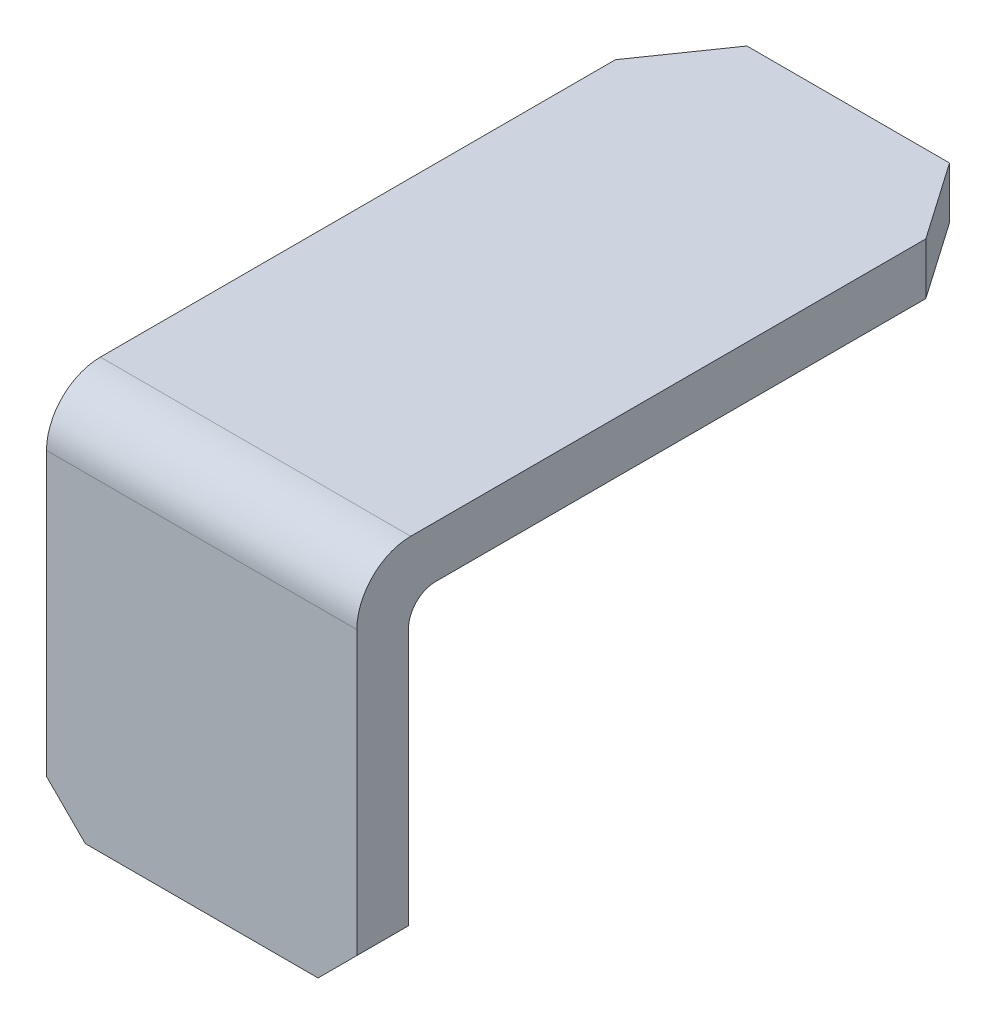
ISO-10303-21;
HEADER;
FILE_DESCRIPTION(('STEP AP214'),'2;1');
FILE_NAME('part.step','',(''),(''),'','','');
FILE_SCHEMA(('AUTOMOTIVE_DESIGN { 1 0 10303 214 1 1 1 1 }'));
ENDSEC;
DATA;
#1=APPLICATION_CONTEXT('core data for automotive mechanical design processes');
#2=APPLICATION_PROTOCOL_DEFINITION('international standard','automotive_design',2000,#1);
#3=PRODUCT_CONTEXT('',#1,'mechanical');
#4=PRODUCT('Part','Part','',(#3));
#5=PRODUCT_RELATED_PRODUCT_CATEGORY('part','',(#4));
#6=PRODUCT_DEFINITION_FORMATION('','',#4);
#7=PRODUCT_DEFINITION_CONTEXT('part definition',#1,'design');
#8=PRODUCT_DEFINITION('design','',#6,#7);
#9=PRODUCT_DEFINITION_SHAPE('','',#8);
#10=(LENGTH_UNIT() NAMED_UNIT(*) SI_UNIT(.MILLI.,.METRE.));
#11=(NAMED_UNIT(*) PLANE_ANGLE_UNIT() SI_UNIT($,.RADIAN.));
#12=(NAMED_UNIT(*) SI_UNIT($,.STERADIAN.) SOLID_ANGLE_UNIT());
#13=UNCERTAINTY_MEASURE_WITH_UNIT(LENGTH_MEASURE(1.E-05),#10,'distance_accuracy_value','');
#14=(GEOMETRIC_REPRESENTATION_CONTEXT(3) GLOBAL_UNCERTAINTY_ASSIGNED_CONTEXT((#13)) GLOBAL_UNIT_ASSIGNED_CONTEXT((#10,
#11,#12)) REPRESENTATION_CONTEXT('',''));
#15=CARTESIAN_POINT('',(0.,0.,0.));
#16=DIRECTION('',(0.,0.,1.));
#17=DIRECTION('',(1.,0.,0.));
#18=AXIS2_PLACEMENT_3D('',#15,#16,#17);
#19=CARTESIAN_POINT('',(-5.64963073780017,-15.4763679848659,-14.9606000000013));
#20=DIRECTION('',(0.,-1.,0.));
#21=DIRECTION('',(1.,0.,0.));
#22=AXIS2_PLACEMENT_3D('',#19,#20,#21);
#23=PLANE('',#22);
#24=DIRECTION('',(0.,0.,1.));
#25=VECTOR('',#24,1.);
#26=CARTESIAN_POINT('',(-7.36413073452841,-15.4763679848658,-15.595600000003));
#27=LINE('',#26,#25);
#28=CARTESIAN_POINT('',(-7.36413073452846,-15.4763679848659,-14.960600000002));
#29=VERTEX_POINT('',#28);
#30=CARTESIAN_POINT('',(-7.36413073452846,-15.4763679848659,-15.7226000000013));
#31=VERTEX_POINT('',#30);
#32=EDGE_CURVE('E237',#29,#31,#27,.F.);
#33=ORIENTED_EDGE('',*,*,#32,.T.);
#34=DIRECTION('',(-1.,0.,0.));
#35=VECTOR('',#34,1.);
#36=CARTESIAN_POINT('',(-5.64963073780017,-15.4763679848659,-15.7226000000013));
#37=LINE('',#36,#35);
#38=CARTESIAN_POINT('',(-3.93513073452857,-15.4763679848658,-15.7226000000013));
#39=VERTEX_POINT('',#38);
#40=EDGE_CURVE('E206',#39,#31,#37,.T.);
#41=ORIENTED_EDGE('',*,*,#40,.F.);
#42=DIRECTION('',(0.,0.,1.));
#43=VECTOR('',#42,1.);
#44=CARTESIAN_POINT('',(-3.93513073452876,-15.4763679848656,-15.5956000000031));
#45=LINE('',#44,#43);
#46=CARTESIAN_POINT('',(-3.93513073452866,-15.4763679848657,-14.9606000000017));
#47=VERTEX_POINT('',#46);
#48=EDGE_CURVE('E207',#39,#47,#45,.T.);
#49=ORIENTED_EDGE('',*,*,#48,.T.);
#50=DIRECTION('',(-1.,0.,0.));
#51=VECTOR('',#50,1.);
#52=CARTESIAN_POINT('',(-3.73034936274053E-13,-15.4763679848659,-14.9606000000024));
#53=LINE('',#52,#51);
#54=EDGE_CURVE('E231',#47,#29,#53,.T.);
#55=ORIENTED_EDGE('',*,*,#54,.T.);
#56=EDGE_LOOP('',(#33,#41,#49,#55));
#57=FACE_BOUND('',#56,.T.);
#58=ADVANCED_FACE('F17',(#57),#23,.T.);
#59=CARTESIAN_POINT('',(-5.64963073780019,-11.110742984866,-16.1194750000013));
#60=DIRECTION('',(-1.,0.,0.));
#61=DIRECTION('',(0.,0.,1.));
#62=AXIS2_PLACEMENT_3D('',#59,#60,#61);
#63=CYLINDRICAL_SURFACE('',#62,0.396875);
#64=DIRECTION('',(1.,0.,0.));
#65=VECTOR('',#64,1.);
#66=CARTESIAN_POINT('',(-5.64963073780019,-10.7138679848659,-16.1194750000012));
#67=LINE('',#66,#65);
#68=CARTESIAN_POINT('',(-3.36363073780018,-10.7138679848659,-16.1194750000013));
#69=VERTEX_POINT('',#68);
#70=CARTESIAN_POINT('',(-7.93563073780018,-10.7138679848659,-16.1194750000013));
#71=VERTEX_POINT('',#70);
#72=EDGE_CURVE('E118',#69,#71,#67,.F.);
#73=ORIENTED_EDGE('',*,*,#72,.F.);
#74=CARTESIAN_POINT('',(-3.36363073780019,-11.110742984866,-16.1194750000013));
#75=DIRECTION('',(-1.,0.,0.));
#76=DIRECTION('',(0.,0.,1.));
#77=AXIS2_PLACEMENT_3D('',#74,#75,#76);
#78=CIRCLE('',#77,0.396875);
#79=CARTESIAN_POINT('',(-3.36363073780019,-11.1107429848659,-15.7226000000013));
#80=VERTEX_POINT('',#79);
#81=EDGE_CURVE('E20',#80,#69,#78,.T.);
#82=ORIENTED_EDGE('',*,*,#81,.F.);
#83=DIRECTION('',(-1.,0.,0.));
#84=VECTOR('',#83,1.);
#85=CARTESIAN_POINT('',(-5.64963073780017,-11.1107429848659,-15.7226000000013));
#86=LINE('',#85,#84);
#87=CARTESIAN_POINT('',(-7.93563073780019,-11.1107429848659,-15.7226000000013));
#88=VERTEX_POINT('',#87);
#89=EDGE_CURVE('E124',#88,#80,#86,.F.);
#90=ORIENTED_EDGE('',*,*,#89,.F.);
#91=CARTESIAN_POINT('',(-7.93563073780019,-11.110742984866,-16.1194750000013));
#92=DIRECTION('',(-1.,0.,0.));
#93=DIRECTION('',(0.,0.,1.));
#94=AXIS2_PLACEMENT_3D('',#91,#92,#93);
#95=CIRCLE('',#94,0.396875);
#96=EDGE_CURVE('E116',#71,#88,#95,.F.);
#97=ORIENTED_EDGE('',*,*,#96,.F.);
#98=EDGE_LOOP('',(#73,#82,#90,#97));
#99=FACE_BOUND('',#98,.T.);
#100=ADVANCED_FACE('F119',(#99),#63,.F.);
#101=CARTESIAN_POINT('',(-12.9089698634811,-9.93152885591314,-15.595600000003));
#102=DIRECTION('',(0.707106781186547,0.707106781186548,0.));
#103=DIRECTION('',(-0.707106781186548,0.707106781186547,0.));
#104=AXIS2_PLACEMENT_3D('',#101,#102,#103);
#105=PLANE('',#104);
#106=DIRECTION('',(-0.707106781186541,0.707106781186554,0.));
#107=VECTOR('',#106,1.);
#108=CARTESIAN_POINT('',(-7.36413073452848,-15.4763679848659,-14.9606000000024));
#109=LINE('',#108,#107);
#110=CARTESIAN_POINT('',(-7.93563073780017,-14.9048679815942,-14.9606000000016));
#111=VERTEX_POINT('',#110);
#112=EDGE_CURVE('E215',#29,#111,#109,.T.);
#113=ORIENTED_EDGE('',*,*,#112,.T.);
#114=DIRECTION('',(0.,0.,-1.));
#115=VECTOR('',#114,1.);
#116=CARTESIAN_POINT('',(-7.93563073780017,-14.9048679815942,-18.3929227095899));
#117=LINE('',#116,#115);
#118=CARTESIAN_POINT('',(-7.93563073780017,-14.9048679815942,-15.7226000000012));
#119=VERTEX_POINT('',#118);
#120=EDGE_CURVE('E177',#111,#119,#117,.T.);
#121=ORIENTED_EDGE('',*,*,#120,.T.);
#122=DIRECTION('',(-0.707106781186541,0.707106781186554,0.));
#123=VECTOR('',#122,1.);
#124=CARTESIAN_POINT('',(-7.36413073452848,-15.4763679848659,-15.7226000000013));
#125=LINE('',#124,#123);
#126=EDGE_CURVE('E202',#31,#119,#125,.T.);
#127=ORIENTED_EDGE('',*,*,#126,.F.);
#128=ORIENTED_EDGE('',*,*,#32,.F.);
#129=EDGE_LOOP('',(#113,#121,#127,#128));
#130=FACE_BOUND('',#129,.T.);
#131=ADVANCED_FACE('F266',(#130),#105,.F.);
#132=CARTESIAN_POINT('',(-3.73034936274053E-13,8.34887714518118E-13,-14.9606000000024));
#133=DIRECTION('',(0.,0.,-1.));
#134=DIRECTION('',(-1.,0.,0.));
#135=AXIS2_PLACEMENT_3D('',#132,#133,#134);
#136=PLANE('',#135);
#137=ORIENTED_EDGE('',*,*,#54,.F.);
#138=DIRECTION('',(-0.707106781186548,-0.707106781186548,0.));
#139=VECTOR('',#138,1.);
#140=CARTESIAN_POINT('',(6.80372662895213,-4.73751062138474,-14.9606000000013));
#141=LINE('',#140,#139);
#142=CARTESIAN_POINT('',(-3.36363073780026,-14.9048679881375,-14.9606000000012));
#143=VERTEX_POINT('',#142);
#144=EDGE_CURVE('E213',#47,#143,#141,.F.);
#145=ORIENTED_EDGE('',*,*,#144,.T.);
#146=DIRECTION('',(0.,1.,0.));
#147=VECTOR('',#146,1.);
#148=CARTESIAN_POINT('',(-3.36363073780017,-11.3493939283856,-14.9606000000012));
#149=LINE('',#148,#147);
#150=CARTESIAN_POINT('',(-3.36363073780018,-10.745617984866,-14.9606000000012));
#151=VERTEX_POINT('',#150);
#152=EDGE_CURVE('E140',#151,#143,#149,.F.);
#153=ORIENTED_EDGE('',*,*,#152,.F.);
#154=DIRECTION('',(-1.,0.,0.));
#155=VECTOR('',#154,1.);
#156=CARTESIAN_POINT('',(-5.64963073780019,-10.745617984866,-14.9606000000012));
#157=LINE('',#156,#155);
#158=CARTESIAN_POINT('',(-7.93563073780018,-10.745617984866,-14.9606000000012));
#159=VERTEX_POINT('',#158);
#160=EDGE_CURVE('E218',#159,#151,#157,.F.);
#161=ORIENTED_EDGE('',*,*,#160,.F.);
#162=DIRECTION('',(0.,1.,0.));
#163=VECTOR('',#162,1.);
#164=CARTESIAN_POINT('',(-7.93563073780017,-11.3493939283856,-14.9606000000012));
#165=LINE('',#164,#163);
#166=EDGE_CURVE('E180',#159,#111,#165,.F.);
#167=ORIENTED_EDGE('',*,*,#166,.T.);
#168=ORIENTED_EDGE('',*,*,#112,.F.);
#169=EDGE_LOOP('',(#137,#145,#153,#161,#167,#168));
#170=FACE_BOUND('',#169,.T.);
#171=ADVANCED_FACE('F272',(#170),#136,.F.);
#172=CARTESIAN_POINT('',(6.80372662895213,-4.73751062138474,-15.5956000000031));
#173=DIRECTION('',(-0.707106781186548,0.707106781186548,0.));
#174=DIRECTION('',(-0.707106781186548,-0.707106781186548,0.));
#175=AXIS2_PLACEMENT_3D('',#172,#173,#174);
#176=PLANE('',#175);
#177=DIRECTION('',(-0.707106781186553,-0.707106781186542,0.));
#178=VECTOR('',#177,1.);
#179=CARTESIAN_POINT('',(-3.36363073780017,-14.9048679881376,-15.7226000000013));
#180=LINE('',#179,#178);
#181=CARTESIAN_POINT('',(-3.36363073780017,-14.9048679881376,-15.7226000000012));
#182=VERTEX_POINT('',#181);
#183=EDGE_CURVE('E203',#182,#39,#180,.T.);
#184=ORIENTED_EDGE('',*,*,#183,.F.);
#185=DIRECTION('',(0.,0.,-1.));
#186=VECTOR('',#185,1.);
#187=CARTESIAN_POINT('',(-3.36363073780017,-14.9048679881376,-18.3929227095899));
#188=LINE('',#187,#186);
#189=EDGE_CURVE('E132',#143,#182,#188,.T.);
#190=ORIENTED_EDGE('',*,*,#189,.F.);
#191=ORIENTED_EDGE('',*,*,#144,.F.);
#192=ORIENTED_EDGE('',*,*,#48,.F.);
#193=EDGE_LOOP('',(#184,#190,#191,#192));
#194=FACE_BOUND('',#193,.T.);
#195=ADVANCED_FACE('F288',(#194),#176,.F.);
#196=CARTESIAN_POINT('',(-5.64963073780017,-15.4763679848659,-15.7226000000013));
#197=DIRECTION('',(0.,0.,-1.));
#198=DIRECTION('',(-1.,0.,0.));
#199=AXIS2_PLACEMENT_3D('',#196,#197,#198);
#200=PLANE('',#199);
#201=ORIENTED_EDGE('',*,*,#89,.T.);
#202=DIRECTION('',(0.,1.,0.));
#203=VECTOR('',#202,1.);
#204=CARTESIAN_POINT('',(-3.36363073780017,-11.3493939283856,-15.7226000000012));
#205=LINE('',#204,#203);
#206=EDGE_CURVE('E115',#182,#80,#205,.T.);
#207=ORIENTED_EDGE('',*,*,#206,.F.);
#208=ORIENTED_EDGE('',*,*,#183,.T.);
#209=ORIENTED_EDGE('',*,*,#40,.T.);
#210=ORIENTED_EDGE('',*,*,#126,.T.);
#211=DIRECTION('',(0.,1.,0.));
#212=VECTOR('',#211,1.);
#213=CARTESIAN_POINT('',(-7.93563073780017,-11.3493939283856,-15.7226000000012));
#214=LINE('',#213,#212);
#215=EDGE_CURVE('E172',#119,#88,#214,.T.);
#216=ORIENTED_EDGE('',*,*,#215,.T.);
#217=EDGE_LOOP('',(#201,#207,#208,#209,#210,#216));
#218=FACE_BOUND('',#217,.T.);
#219=ADVANCED_FACE('F261',(#218),#200,.T.);
#220=CARTESIAN_POINT('',(-5.64963073780019,-10.7138679848659,-16.1194750000012));
#221=DIRECTION('',(0.,-1.,0.));
#222=DIRECTION('',(1.,0.,0.));
#223=AXIS2_PLACEMENT_3D('',#220,#221,#222);
#224=PLANE('',#223);
#225=DIRECTION('',(-1.,0.,0.));
#226=VECTOR('',#225,1.);
#227=CARTESIAN_POINT('',(-5.64963073780035,-10.7138679848655,-24.4856000000024));
#228=LINE('',#227,#226);
#229=CARTESIAN_POINT('',(-4.15738073780026,-10.7138679848655,-24.4856000000025));
#230=VERTEX_POINT('',#229);
#231=CARTESIAN_POINT('',(-7.14188073780036,-10.7138679848657,-24.4856000000024));
#232=VERTEX_POINT('',#231);
#233=EDGE_CURVE('E193',#230,#232,#228,.T.);
#234=ORIENTED_EDGE('',*,*,#233,.F.);
#235=DIRECTION('',(-0.570395809495346,0.,-0.821369965673295));
#236=VECTOR('',#235,1.);
#237=CARTESIAN_POINT('',(-3.76050573780034,-10.7138679848655,-23.9141000000026));
#238=LINE('',#237,#236);
#239=CARTESIAN_POINT('',(-3.36363073780024,-10.7138679848656,-23.3426000000025));
#240=VERTEX_POINT('',#239);
#241=EDGE_CURVE('E128',#240,#230,#238,.T.);
#242=ORIENTED_EDGE('',*,*,#241,.F.);
#243=DIRECTION('',(0.,0.,-1.));
#244=VECTOR('',#243,1.);
#245=CARTESIAN_POINT('',(-3.36363073780017,-10.7138679848659,-18.3929227095899));
#246=LINE('',#245,#244);
#247=EDGE_CURVE('E111',#69,#240,#246,.T.);
#248=ORIENTED_EDGE('',*,*,#247,.F.);
#249=ORIENTED_EDGE('',*,*,#72,.T.);
#250=DIRECTION('',(0.,0.,-1.));
#251=VECTOR('',#250,1.);
#252=CARTESIAN_POINT('',(-7.93563073780017,-10.7138679848659,-18.3929227095899));
#253=LINE('',#252,#251);
#254=CARTESIAN_POINT('',(-7.93563073780027,-10.7138679848658,-23.3426000000025));
#255=VERTEX_POINT('',#254);
#256=EDGE_CURVE('E169',#71,#255,#253,.T.);
#257=ORIENTED_EDGE('',*,*,#256,.T.);
#258=DIRECTION('',(0.570395809495344,0.,-0.821369965673296));
#259=VECTOR('',#258,1.);
#260=CARTESIAN_POINT('',(-7.93563073780035,-10.7138679848659,-23.3426000000024));
#261=LINE('',#260,#259);
#262=EDGE_CURVE('E123',#255,#232,#261,.T.);
#263=ORIENTED_EDGE('',*,*,#262,.T.);
#264=EDGE_LOOP('',(#234,#242,#248,#249,#257,#263));
#265=FACE_BOUND('',#264,.T.);
#266=ADVANCED_FACE('F127',(#265),#224,.T.);
#267=CARTESIAN_POINT('',(-7.93563073780017,-11.3493939283856,-18.3929227095899));
#268=DIRECTION('',(1.,0.,0.));
#269=DIRECTION('',(0.,0.,-1.));
#270=AXIS2_PLACEMENT_3D('',#267,#268,#269);
#271=PLANE('',#270);
#272=ORIENTED_EDGE('',*,*,#96,.T.);
#273=ORIENTED_EDGE('',*,*,#215,.F.);
#274=ORIENTED_EDGE('',*,*,#120,.F.);
#275=ORIENTED_EDGE('',*,*,#166,.F.);
#276=CARTESIAN_POINT('',(-7.93563073780019,-10.745617984866,-15.7543500000012));
#277=DIRECTION('',(-1.,0.,0.));
#278=DIRECTION('',(0.,0.,1.));
#279=AXIS2_PLACEMENT_3D('',#276,#277,#278);
#280=CIRCLE('',#279,0.79375);
#281=CARTESIAN_POINT('',(-7.93563073780027,-9.95186798486595,-15.7543500000012));
#282=VERTEX_POINT('',#281);
#283=EDGE_CURVE('E171',#282,#159,#280,.F.);
#284=ORIENTED_EDGE('',*,*,#283,.F.);
#285=DIRECTION('',(0.,0.,1.));
#286=VECTOR('',#285,1.);
#287=CARTESIAN_POINT('',(-7.93563073780035,-9.95186798486595,-24.4856000000012));
#288=LINE('',#287,#286);
#289=CARTESIAN_POINT('',(-7.93563073780038,-9.95186798486595,-23.3426000000024));
#290=VERTEX_POINT('',#289);
#291=EDGE_CURVE('E150',#290,#282,#288,.T.);
#292=ORIENTED_EDGE('',*,*,#291,.F.);
#293=DIRECTION('',(0.,1.,0.));
#294=VECTOR('',#293,1.);
#295=CARTESIAN_POINT('',(-7.93563073780045,-11.0316309566253,-23.3426000000025));
#296=LINE('',#295,#294);
#297=EDGE_CURVE('E166',#255,#290,#296,.T.);
#298=ORIENTED_EDGE('',*,*,#297,.F.);
#299=ORIENTED_EDGE('',*,*,#256,.F.);
#300=EDGE_LOOP('',(#272,#273,#274,#275,#284,#292,#298,#299));
#301=FACE_BOUND('',#300,.T.);
#302=ADVANCED_FACE('F257',(#301),#271,.F.);
#303=CARTESIAN_POINT('',(-5.64963073780019,-10.745617984866,-15.7543500000012));
#304=DIRECTION('',(-1.,0.,0.));
#305=DIRECTION('',(0.,0.,1.));
#306=AXIS2_PLACEMENT_3D('',#303,#304,#305);
#307=CYLINDRICAL_SURFACE('',#306,0.79375);
#308=CARTESIAN_POINT('',(-3.36363073780019,-10.745617984866,-15.7543500000012));
#309=DIRECTION('',(-1.,0.,0.));
#310=DIRECTION('',(0.,0.,1.));
#311=AXIS2_PLACEMENT_3D('',#308,#309,#310);
#312=CIRCLE('',#311,0.79375);
#313=CARTESIAN_POINT('',(-3.36363073780019,-9.95186798486595,-15.7543500000012));
#314=VERTEX_POINT('',#313);
#315=EDGE_CURVE('E143',#314,#151,#312,.F.);
#316=ORIENTED_EDGE('',*,*,#315,.F.);
#317=DIRECTION('',(-1.,0.,0.));
#318=VECTOR('',#317,1.);
#319=CARTESIAN_POINT('',(-5.64963073780017,-9.95186798486595,-15.7543500000012));
#320=LINE('',#319,#318);
#321=EDGE_CURVE('E146',#282,#314,#320,.F.);
#322=ORIENTED_EDGE('',*,*,#321,.F.);
#323=ORIENTED_EDGE('',*,*,#283,.T.);
#324=ORIENTED_EDGE('',*,*,#160,.T.);
#325=EDGE_LOOP('',(#316,#322,#323,#324));
#326=FACE_BOUND('',#325,.T.);
#327=ADVANCED_FACE('F274',(#326),#307,.T.);
#328=CARTESIAN_POINT('',(-3.36363073780017,-11.3493939283856,-18.3929227095899));
#329=DIRECTION('',(1.,0.,0.));
#330=DIRECTION('',(0.,0.,-1.));
#331=AXIS2_PLACEMENT_3D('',#328,#329,#330);
#332=PLANE('',#331);
#333=ORIENTED_EDGE('',*,*,#247,.T.);
#334=DIRECTION('',(0.,1.,0.));
#335=VECTOR('',#334,1.);
#336=CARTESIAN_POINT('',(-3.3636307378003,-11.0316309566254,-23.3426000000025));
#337=LINE('',#336,#335);
#338=CARTESIAN_POINT('',(-3.36363073780025,-9.95186798486595,-23.3426000000024));
#339=VERTEX_POINT('',#338);
#340=EDGE_CURVE('E130',#339,#240,#337,.F.);
#341=ORIENTED_EDGE('',*,*,#340,.F.);
#342=DIRECTION('',(0.,0.,1.));
#343=VECTOR('',#342,1.);
#344=CARTESIAN_POINT('',(-3.36363073780019,-9.95186798486595,-24.4856000000012));
#345=LINE('',#344,#343);
#346=EDGE_CURVE('E149',#314,#339,#345,.F.);
#347=ORIENTED_EDGE('',*,*,#346,.F.);
#348=ORIENTED_EDGE('',*,*,#315,.T.);
#349=ORIENTED_EDGE('',*,*,#152,.T.);
#350=ORIENTED_EDGE('',*,*,#189,.T.);
#351=ORIENTED_EDGE('',*,*,#206,.T.);
#352=ORIENTED_EDGE('',*,*,#81,.T.);
#353=EDGE_LOOP('',(#333,#341,#347,#348,#349,#350,#351,#352));
#354=FACE_BOUND('',#353,.T.);
#355=ADVANCED_FACE('F109',(#354),#332,.T.);
#356=CARTESIAN_POINT('',(-3.76050573780034,-11.0316309566254,-23.9141000000026));
#357=DIRECTION('',(0.821369965673295,0.,-0.570395809495346));
#358=DIRECTION('',(-0.570395809495346,0.,-0.821369965673295));
#359=AXIS2_PLACEMENT_3D('',#356,#357,#358);
#360=PLANE('',#359);
#361=DIRECTION('',(-0.570395809495349,0.,-0.821369965673293));
#362=VECTOR('',#361,1.);
#363=CARTESIAN_POINT('',(-3.36363073780035,-9.95186798486595,-23.3426000000025));
#364=LINE('',#363,#362);
#365=CARTESIAN_POINT('',(-4.15738073780031,-9.95186798486564,-24.4856000000025));
#366=VERTEX_POINT('',#365);
#367=EDGE_CURVE('E153',#339,#366,#364,.T.);
#368=ORIENTED_EDGE('',*,*,#367,.F.);
#369=ORIENTED_EDGE('',*,*,#340,.T.);
#370=ORIENTED_EDGE('',*,*,#241,.T.);
#371=DIRECTION('',(0.,1.,0.));
#372=VECTOR('',#371,1.);
#373=CARTESIAN_POINT('',(-4.15738073780036,-10.7138679848655,-24.4856000000024));
#374=LINE('',#373,#372);
#375=EDGE_CURVE('E161',#366,#230,#374,.F.);
#376=ORIENTED_EDGE('',*,*,#375,.F.);
#377=EDGE_LOOP('',(#368,#369,#370,#376));
#378=FACE_BOUND('',#377,.T.);
#379=ADVANCED_FACE('F284',(#378),#360,.T.);
#380=CARTESIAN_POINT('',(-5.64963073780035,-10.7138679848655,-24.4856000000024));
#381=DIRECTION('',(0.,0.,-1.));
#382=DIRECTION('',(-1.,0.,0.));
#383=AXIS2_PLACEMENT_3D('',#380,#381,#382);
#384=PLANE('',#383);
#385=DIRECTION('',(0.,1.,0.));
#386=VECTOR('',#385,1.);
#387=CARTESIAN_POINT('',(-7.14188073780045,-11.0316309566253,-24.4856000000025));
#388=LINE('',#387,#386);
#389=CARTESIAN_POINT('',(-7.14188073780036,-9.95186798486563,-24.4856000000024));
#390=VERTEX_POINT('',#389);
#391=EDGE_CURVE('E35',#390,#232,#388,.F.);
#392=ORIENTED_EDGE('',*,*,#391,.F.);
#393=DIRECTION('',(-1.,0.,0.));
#394=VECTOR('',#393,1.);
#395=CARTESIAN_POINT('',(-5.64963073780017,-9.95186798486595,-24.4856000000025));
#396=LINE('',#395,#394);
#397=EDGE_CURVE('E26',#366,#390,#396,.T.);
#398=ORIENTED_EDGE('',*,*,#397,.F.);
#399=ORIENTED_EDGE('',*,*,#375,.T.);
#400=ORIENTED_EDGE('',*,*,#233,.T.);
#401=EDGE_LOOP('',(#392,#398,#399,#400));
#402=FACE_BOUND('',#401,.T.);
#403=ADVANCED_FACE('F281',(#402),#384,.T.);
#404=CARTESIAN_POINT('',(-7.53875573780036,-11.0316309566253,-23.9141000000026));
#405=DIRECTION('',(-0.821369965673297,0.,-0.570395809495343));
#406=DIRECTION('',(-0.570395809495343,0.,0.821369965673297));
#407=AXIS2_PLACEMENT_3D('',#404,#405,#406);
#408=PLANE('',#407);
#409=ORIENTED_EDGE('',*,*,#262,.F.);
#410=ORIENTED_EDGE('',*,*,#297,.T.);
#411=DIRECTION('',(-0.570395809495339,0.,0.821369965673299));
#412=VECTOR('',#411,1.);
#413=CARTESIAN_POINT('',(-7.14188073780036,-9.95186798486595,-24.4856000000024));
#414=LINE('',#413,#412);
#415=EDGE_CURVE('E11',#390,#290,#414,.T.);
#416=ORIENTED_EDGE('',*,*,#415,.F.);
#417=ORIENTED_EDGE('',*,*,#391,.T.);
#418=EDGE_LOOP('',(#409,#410,#416,#417));
#419=FACE_BOUND('',#418,.T.);
#420=ADVANCED_FACE('F280',(#419),#408,.T.);
#421=CARTESIAN_POINT('',(-5.64963073780017,-9.95186798486595,-24.4856000000012));
#422=DIRECTION('',(0.,1.,0.));
#423=DIRECTION('',(-1.,0.,0.));
#424=AXIS2_PLACEMENT_3D('',#421,#422,#423);
#425=PLANE('',#424);
#426=ORIENTED_EDGE('',*,*,#397,.T.);
#427=ORIENTED_EDGE('',*,*,#415,.T.);
#428=ORIENTED_EDGE('',*,*,#291,.T.);
#429=ORIENTED_EDGE('',*,*,#321,.T.);
#430=ORIENTED_EDGE('',*,*,#346,.T.);
#431=ORIENTED_EDGE('',*,*,#367,.T.);
#432=EDGE_LOOP('',(#426,#427,#428,#429,#430,#431));
#433=FACE_BOUND('',#432,.T.);
#434=ADVANCED_FACE('F278',(#433),#425,.T.);
#435=CLOSED_SHELL('',(#58,#100,#131,#171,#195,#219,#266,#302,#327,#355,#379,#403,#420,#434));
#436=MANIFOLD_SOLID_BREP('B1',#435);
#437=ADVANCED_BREP_SHAPE_REPRESENTATION('',(#18,#436),#14);
#438=SHAPE_DEFINITION_REPRESENTATION(#9,#437);
ENDSEC;
END-ISO-10303-21;
